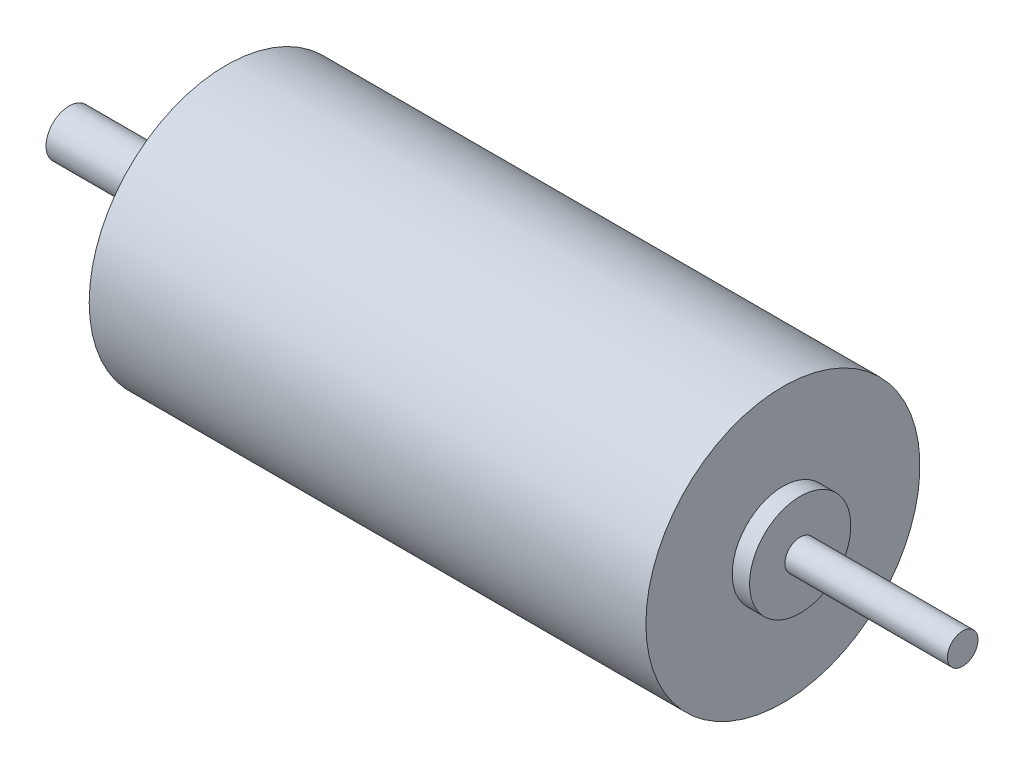
ISO-10303-21;
HEADER;
FILE_DESCRIPTION(('STEP AP214'),'2;1');
FILE_NAME('part.step','',(''),(''),'','','');
FILE_SCHEMA(('AUTOMOTIVE_DESIGN { 1 0 10303 214 1 1 1 1 }'));
ENDSEC;
DATA;
#1=APPLICATION_CONTEXT('core data for automotive mechanical design processes');
#2=APPLICATION_PROTOCOL_DEFINITION('international standard','automotive_design',2000,#1);
#3=PRODUCT_CONTEXT('',#1,'mechanical');
#4=PRODUCT('Part','Part','',(#3));
#5=PRODUCT_RELATED_PRODUCT_CATEGORY('part','',(#4));
#6=PRODUCT_DEFINITION_FORMATION('','',#4);
#7=PRODUCT_DEFINITION_CONTEXT('part definition',#1,'design');
#8=PRODUCT_DEFINITION('design','',#6,#7);
#9=PRODUCT_DEFINITION_SHAPE('','',#8);
#10=(LENGTH_UNIT() NAMED_UNIT(*) SI_UNIT(.MILLI.,.METRE.));
#11=(NAMED_UNIT(*) PLANE_ANGLE_UNIT() SI_UNIT($,.RADIAN.));
#12=(NAMED_UNIT(*) SI_UNIT($,.STERADIAN.) SOLID_ANGLE_UNIT());
#13=UNCERTAINTY_MEASURE_WITH_UNIT(LENGTH_MEASURE(1.E-05),#10,'distance_accuracy_value','');
#14=(GEOMETRIC_REPRESENTATION_CONTEXT(3) GLOBAL_UNCERTAINTY_ASSIGNED_CONTEXT((#13)) GLOBAL_UNIT_ASSIGNED_CONTEXT((#10,
#11,#12)) REPRESENTATION_CONTEXT('',''));
#15=CARTESIAN_POINT('',(0.,0.,0.));
#16=DIRECTION('',(0.,0.,1.));
#17=DIRECTION('',(1.,0.,0.));
#18=AXIS2_PLACEMENT_3D('',#15,#16,#17);
#19=CARTESIAN_POINT('',(-106.458572993505,10.3130030265991,0.));
#20=DIRECTION('',(1.,0.,0.));
#21=DIRECTION('',(0.,0.,-1.));
#22=AXIS2_PLACEMENT_3D('',#19,#20,#21);
#23=PLANE('',#22);
#24=CARTESIAN_POINT('',(-106.458572993505,10.3130030265991,0.));
#25=DIRECTION('',(-1.,0.,0.));
#26=DIRECTION('',(0.,0.,1.));
#27=AXIS2_PLACEMENT_3D('',#24,#25,#26);
#28=CIRCLE('',#27,2.95);
#29=CARTESIAN_POINT('',(-106.458572993505,10.3130030265991,2.95));
#30=VERTEX_POINT('',#29);
#31=EDGE_CURVE('E10',#30,#30,#28,.T.);
#32=ORIENTED_EDGE('',*,*,#31,.T.);
#33=EDGE_LOOP('',(#32));
#34=FACE_BOUND('',#33,.T.);
#35=ADVANCED_FACE('F34',(#34),#23,.F.);
#36=CARTESIAN_POINT('',(-106.458572993505,10.3130030265991,0.));
#37=DIRECTION('',(-1.,0.,0.));
#38=DIRECTION('',(0.,0.,1.));
#39=AXIS2_PLACEMENT_3D('',#36,#37,#38);
#40=CYLINDRICAL_SURFACE('',#39,2.95);
#41=ORIENTED_EDGE('',*,*,#31,.F.);
#42=EDGE_LOOP('',(#41));
#43=FACE_BOUND('',#42,.T.);
#44=CARTESIAN_POINT('',(-88.658572993505,10.3130030265991,0.));
#45=DIRECTION('',(-1.,0.,0.));
#46=DIRECTION('',(0.,0.,1.));
#47=AXIS2_PLACEMENT_3D('',#44,#45,#46);
#48=CIRCLE('',#47,2.95);
#49=CARTESIAN_POINT('',(-88.658572993505,10.3130030265991,2.95));
#50=VERTEX_POINT('',#49);
#51=EDGE_CURVE('E40',#50,#50,#48,.T.);
#52=ORIENTED_EDGE('',*,*,#51,.T.);
#53=EDGE_LOOP('',(#52));
#54=FACE_BOUND('',#53,.T.);
#55=ADVANCED_FACE('F84',(#43,#54),#40,.T.);
#56=CARTESIAN_POINT('',(-88.658572993505,13.2630030265991,0.));
#57=DIRECTION('',(1.,0.,0.));
#58=DIRECTION('',(0.,0.,-1.));
#59=AXIS2_PLACEMENT_3D('',#56,#57,#58);
#60=PLANE('',#59);
#61=ORIENTED_EDGE('',*,*,#51,.F.);
#62=EDGE_LOOP('',(#61));
#63=FACE_BOUND('',#62,.T.);
#64=CARTESIAN_POINT('',(-88.658572993505,10.3130030265991,0.));
#65=DIRECTION('',(-1.,0.,0.));
#66=DIRECTION('',(0.,0.,1.));
#67=AXIS2_PLACEMENT_3D('',#64,#65,#66);
#68=CIRCLE('',#67,6.45);
#69=CARTESIAN_POINT('',(-88.658572993505,10.3130030265991,6.45));
#70=VERTEX_POINT('',#69);
#71=EDGE_CURVE('E44',#70,#70,#68,.T.);
#72=ORIENTED_EDGE('',*,*,#71,.T.);
#73=EDGE_LOOP('',(#72));
#74=FACE_BOUND('',#73,.T.);
#75=ADVANCED_FACE('F88',(#63,#74),#60,.F.);
#76=CARTESIAN_POINT('',(-106.458572993505,10.3130030265991,0.));
#77=DIRECTION('',(-1.,0.,0.));
#78=DIRECTION('',(0.,0.,1.));
#79=AXIS2_PLACEMENT_3D('',#76,#77,#78);
#80=CYLINDRICAL_SURFACE('',#79,6.45);
#81=ORIENTED_EDGE('',*,*,#71,.F.);
#82=EDGE_LOOP('',(#81));
#83=FACE_BOUND('',#82,.T.);
#84=CARTESIAN_POINT('',(-86.458572993505,10.3130030265991,0.));
#85=DIRECTION('',(-1.,0.,0.));
#86=DIRECTION('',(0.,0.,1.));
#87=AXIS2_PLACEMENT_3D('',#84,#85,#86);
#88=CIRCLE('',#87,6.45);
#89=CARTESIAN_POINT('',(-86.458572993505,10.3130030265991,6.45));
#90=VERTEX_POINT('',#89);
#91=EDGE_CURVE('E48',#90,#90,#88,.T.);
#92=ORIENTED_EDGE('',*,*,#91,.T.);
#93=EDGE_LOOP('',(#92));
#94=FACE_BOUND('',#93,.T.);
#95=ADVANCED_FACE('F93',(#83,#94),#80,.T.);
#96=CARTESIAN_POINT('',(-86.458572993505,16.7630030265991,0.));
#97=DIRECTION('',(1.,0.,0.));
#98=DIRECTION('',(0.,0.,-1.));
#99=AXIS2_PLACEMENT_3D('',#96,#97,#98);
#100=PLANE('',#99);
#101=ORIENTED_EDGE('',*,*,#91,.F.);
#102=EDGE_LOOP('',(#101));
#103=FACE_BOUND('',#102,.T.);
#104=CARTESIAN_POINT('',(-86.458572993505,10.3130030265991,0.));
#105=DIRECTION('',(-1.,0.,0.));
#106=DIRECTION('',(0.,0.,1.));
#107=AXIS2_PLACEMENT_3D('',#104,#105,#106);
#108=CIRCLE('',#107,17.45);
#109=CARTESIAN_POINT('',(-86.458572993505,10.3130030265991,17.45));
#110=VERTEX_POINT('',#109);
#111=EDGE_CURVE('E53',#110,#110,#108,.T.);
#112=ORIENTED_EDGE('',*,*,#111,.T.);
#113=EDGE_LOOP('',(#112));
#114=FACE_BOUND('',#113,.T.);
#115=ADVANCED_FACE('F99',(#103,#114),#100,.F.);
#116=CARTESIAN_POINT('',(-106.458572993505,10.3130030265991,0.));
#117=DIRECTION('',(-1.,0.,0.));
#118=DIRECTION('',(0.,0.,1.));
#119=AXIS2_PLACEMENT_3D('',#116,#117,#118);
#120=CYLINDRICAL_SURFACE('',#119,17.45);
#121=ORIENTED_EDGE('',*,*,#111,.F.);
#122=EDGE_LOOP('',(#121));
#123=FACE_BOUND('',#122,.T.);
#124=CARTESIAN_POINT('',(-15.558572993505,10.3130030265991,0.));
#125=DIRECTION('',(-1.,0.,0.));
#126=DIRECTION('',(0.,0.,1.));
#127=AXIS2_PLACEMENT_3D('',#124,#125,#126);
#128=CIRCLE('',#127,17.45);
#129=CARTESIAN_POINT('',(-15.558572993505,10.3130030265991,17.45));
#130=VERTEX_POINT('',#129);
#131=EDGE_CURVE('E56',#130,#130,#128,.T.);
#132=ORIENTED_EDGE('',*,*,#131,.T.);
#133=EDGE_LOOP('',(#132));
#134=FACE_BOUND('',#133,.T.);
#135=ADVANCED_FACE('F103',(#123,#134),#120,.T.);
#136=CARTESIAN_POINT('',(-15.558572993505,27.7630030265991,0.));
#137=DIRECTION('',(-1.,0.,0.));
#138=DIRECTION('',(0.,0.,1.));
#139=AXIS2_PLACEMENT_3D('',#136,#137,#138);
#140=PLANE('',#139);
#141=ORIENTED_EDGE('',*,*,#131,.F.);
#142=EDGE_LOOP('',(#141));
#143=FACE_BOUND('',#142,.T.);
#144=CARTESIAN_POINT('',(-15.558572993505,10.3130030265991,0.));
#145=DIRECTION('',(-1.,0.,0.));
#146=DIRECTION('',(0.,0.,1.));
#147=AXIS2_PLACEMENT_3D('',#144,#145,#146);
#148=CIRCLE('',#147,6.45);
#149=CARTESIAN_POINT('',(-15.558572993505,10.3130030265991,6.45));
#150=VERTEX_POINT('',#149);
#151=EDGE_CURVE('E59',#150,#150,#148,.T.);
#152=ORIENTED_EDGE('',*,*,#151,.T.);
#153=EDGE_LOOP('',(#152));
#154=FACE_BOUND('',#153,.T.);
#155=ADVANCED_FACE('F107',(#143,#154),#140,.F.);
#156=CARTESIAN_POINT('',(-106.458572993505,10.3130030265991,0.));
#157=DIRECTION('',(-1.,0.,0.));
#158=DIRECTION('',(0.,0.,1.));
#159=AXIS2_PLACEMENT_3D('',#156,#157,#158);
#160=CYLINDRICAL_SURFACE('',#159,6.45);
#161=ORIENTED_EDGE('',*,*,#151,.F.);
#162=EDGE_LOOP('',(#161));
#163=FACE_BOUND('',#162,.T.);
#164=CARTESIAN_POINT('',(-13.358572993505,10.3130030265991,0.));
#165=DIRECTION('',(-1.,0.,0.));
#166=DIRECTION('',(0.,0.,1.));
#167=AXIS2_PLACEMENT_3D('',#164,#165,#166);
#168=CIRCLE('',#167,6.45);
#169=CARTESIAN_POINT('',(-13.358572993505,10.3130030265991,6.45));
#170=VERTEX_POINT('',#169);
#171=EDGE_CURVE('E62',#170,#170,#168,.T.);
#172=ORIENTED_EDGE('',*,*,#171,.T.);
#173=EDGE_LOOP('',(#172));
#174=FACE_BOUND('',#173,.T.);
#175=ADVANCED_FACE('F111',(#163,#174),#160,.T.);
#176=CARTESIAN_POINT('',(-13.358572993505,16.7630030265991,0.));
#177=DIRECTION('',(-1.,0.,0.));
#178=DIRECTION('',(0.,0.,1.));
#179=AXIS2_PLACEMENT_3D('',#176,#177,#178);
#180=PLANE('',#179);
#181=ORIENTED_EDGE('',*,*,#171,.F.);
#182=EDGE_LOOP('',(#181));
#183=FACE_BOUND('',#182,.T.);
#184=CARTESIAN_POINT('',(-13.358572993505,10.3130030265991,0.));
#185=DIRECTION('',(-1.,0.,0.));
#186=DIRECTION('',(0.,0.,1.));
#187=AXIS2_PLACEMENT_3D('',#184,#185,#186);
#188=CIRCLE('',#187,1.95);
#189=CARTESIAN_POINT('',(-13.358572993505,10.3130030265991,1.95));
#190=VERTEX_POINT('',#189);
#191=EDGE_CURVE('E65',#190,#190,#188,.T.);
#192=ORIENTED_EDGE('',*,*,#191,.T.);
#193=EDGE_LOOP('',(#192));
#194=FACE_BOUND('',#193,.T.);
#195=ADVANCED_FACE('F80',(#183,#194),#180,.F.);
#196=CARTESIAN_POINT('',(-106.458572993505,10.3130030265991,0.));
#197=DIRECTION('',(-1.,0.,0.));
#198=DIRECTION('',(0.,0.,1.));
#199=AXIS2_PLACEMENT_3D('',#196,#197,#198);
#200=CYLINDRICAL_SURFACE('',#199,1.95);
#201=ORIENTED_EDGE('',*,*,#191,.F.);
#202=EDGE_LOOP('',(#201));
#203=FACE_BOUND('',#202,.T.);
#204=CARTESIAN_POINT('',(7.341427006495,10.3130030265991,0.));
#205=DIRECTION('',(-1.,0.,0.));
#206=DIRECTION('',(0.,0.,1.));
#207=AXIS2_PLACEMENT_3D('',#204,#205,#206);
#208=CIRCLE('',#207,1.95);
#209=CARTESIAN_POINT('',(7.341427006495,10.3130030265991,1.95));
#210=VERTEX_POINT('',#209);
#211=EDGE_CURVE('E68',#210,#210,#208,.T.);
#212=ORIENTED_EDGE('',*,*,#211,.T.);
#213=EDGE_LOOP('',(#212));
#214=FACE_BOUND('',#213,.T.);
#215=ADVANCED_FACE('F72',(#203,#214),#200,.T.);
#216=CARTESIAN_POINT('',(7.341427006495,12.2630030265991,0.));
#217=DIRECTION('',(-1.,0.,0.));
#218=DIRECTION('',(0.,0.,1.));
#219=AXIS2_PLACEMENT_3D('',#216,#217,#218);
#220=PLANE('',#219);
#221=ORIENTED_EDGE('',*,*,#211,.F.);
#222=EDGE_LOOP('',(#221));
#223=FACE_BOUND('',#222,.T.);
#224=ADVANCED_FACE('F74',(#223),#220,.F.);
#225=CLOSED_SHELL('',(#35,#55,#75,#95,#115,#135,#155,#175,#195,#215,#224));
#226=MANIFOLD_SOLID_BREP('B2',#225);
#227=ADVANCED_BREP_SHAPE_REPRESENTATION('',(#18,#226),#14);
#228=SHAPE_DEFINITION_REPRESENTATION(#9,#227);
ENDSEC;
END-ISO-10303-21;
